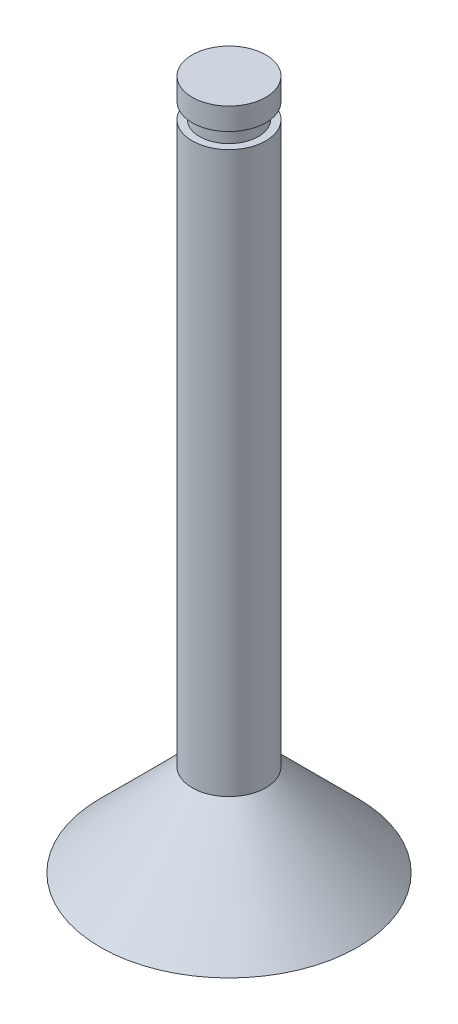
ISO-10303-21;
HEADER;
FILE_DESCRIPTION(('STEP AP214'),'2;1');
FILE_NAME('part.step','',(''),(''),'','','');
FILE_SCHEMA(('AUTOMOTIVE_DESIGN { 1 0 10303 214 1 1 1 1 }'));
ENDSEC;
DATA;
#1=APPLICATION_CONTEXT('core data for automotive mechanical design processes');
#2=APPLICATION_PROTOCOL_DEFINITION('international standard','automotive_design',2000,#1);
#3=PRODUCT_CONTEXT('',#1,'mechanical');
#4=PRODUCT('Part','Part','',(#3));
#5=PRODUCT_RELATED_PRODUCT_CATEGORY('part','',(#4));
#6=PRODUCT_DEFINITION_FORMATION('','',#4);
#7=PRODUCT_DEFINITION_CONTEXT('part definition',#1,'design');
#8=PRODUCT_DEFINITION('design','',#6,#7);
#9=PRODUCT_DEFINITION_SHAPE('','',#8);
#10=(LENGTH_UNIT() NAMED_UNIT(*) SI_UNIT(.MILLI.,.METRE.));
#11=(NAMED_UNIT(*) PLANE_ANGLE_UNIT() SI_UNIT($,.RADIAN.));
#12=(NAMED_UNIT(*) SI_UNIT($,.STERADIAN.) SOLID_ANGLE_UNIT());
#13=UNCERTAINTY_MEASURE_WITH_UNIT(LENGTH_MEASURE(1.E-05),#10,'distance_accuracy_value','');
#14=(GEOMETRIC_REPRESENTATION_CONTEXT(3) GLOBAL_UNCERTAINTY_ASSIGNED_CONTEXT((#13)) GLOBAL_UNIT_ASSIGNED_CONTEXT((#10,
#11,#12)) REPRESENTATION_CONTEXT('',''));
#15=CARTESIAN_POINT('',(0.,0.,0.));
#16=DIRECTION('',(0.,0.,1.));
#17=DIRECTION('',(1.,0.,0.));
#18=AXIS2_PLACEMENT_3D('',#15,#16,#17);
#19=CARTESIAN_POINT('',(0.,0.,0.));
#20=DIRECTION('',(0.,1.,0.));
#21=DIRECTION('',(0.,0.,1.));
#22=AXIS2_PLACEMENT_3D('',#19,#20,#21);
#23=PLANE('',#22);
#24=CARTESIAN_POINT('',(0.,0.,0.));
#25=DIRECTION('',(0.,1.,0.));
#26=DIRECTION('',(0.,0.,1.));
#27=AXIS2_PLACEMENT_3D('',#24,#25,#26);
#28=CIRCLE('',#27,7.);
#29=CARTESIAN_POINT('',(0.,0.,7.));
#30=VERTEX_POINT('',#29);
#31=EDGE_CURVE('E10',#30,#30,#28,.T.);
#32=ORIENTED_EDGE('',*,*,#31,.F.);
#33=EDGE_LOOP('',(#32));
#34=FACE_BOUND('',#33,.T.);
#35=ADVANCED_FACE('F43',(#34),#23,.F.);
#36=CARTESIAN_POINT('',(0.,0.,0.));
#37=DIRECTION('',(0.,-1.,0.));
#38=DIRECTION('',(0.,0.,-1.));
#39=AXIS2_PLACEMENT_3D('',#36,#37,#38);
#40=CONICAL_SURFACE('',#39,7.,0.785398163397454);
#41=CARTESIAN_POINT('',(0.,4.99999999999994,0.));
#42=DIRECTION('',(0.,1.,0.));
#43=DIRECTION('',(0.,0.,1.));
#44=AXIS2_PLACEMENT_3D('',#41,#42,#43);
#45=CIRCLE('',#44,2.00000000000001);
#46=CARTESIAN_POINT('',(0.,4.99999999999994,2.00000000000001));
#47=VERTEX_POINT('',#46);
#48=EDGE_CURVE('E50',#47,#47,#45,.T.);
#49=ORIENTED_EDGE('',*,*,#48,.F.);
#50=EDGE_LOOP('',(#49));
#51=FACE_BOUND('',#50,.T.);
#52=ORIENTED_EDGE('',*,*,#31,.T.);
#53=EDGE_LOOP('',(#52));
#54=FACE_BOUND('',#53,.T.);
#55=ADVANCED_FACE('F107',(#51,#54),#40,.T.);
#56=CARTESIAN_POINT('',(0.,39.7321428571428,0.));
#57=DIRECTION('',(0.,1.,0.));
#58=DIRECTION('',(0.,0.,1.));
#59=AXIS2_PLACEMENT_3D('',#56,#57,#58);
#60=CYLINDRICAL_SURFACE('',#59,2.00000000000001);
#61=CARTESIAN_POINT('',(0.,35.45,0.));
#62=DIRECTION('',(0.,1.,0.));
#63=DIRECTION('',(0.,0.,1.));
#64=AXIS2_PLACEMENT_3D('',#61,#62,#63);
#65=CIRCLE('',#64,2.00000000000001);
#66=CARTESIAN_POINT('',(0.,35.45,2.00000000000001));
#67=VERTEX_POINT('',#66);
#68=EDGE_CURVE('E55',#67,#67,#65,.T.);
#69=ORIENTED_EDGE('',*,*,#68,.F.);
#70=EDGE_LOOP('',(#69));
#71=FACE_BOUND('',#70,.T.);
#72=ORIENTED_EDGE('',*,*,#48,.T.);
#73=EDGE_LOOP('',(#72));
#74=FACE_BOUND('',#73,.T.);
#75=ADVANCED_FACE('F102',(#71,#74),#60,.T.);
#76=CARTESIAN_POINT('',(2.00000000000001,35.45,0.));
#77=DIRECTION('',(0.,-1.,0.));
#78=DIRECTION('',(0.,0.,-1.));
#79=AXIS2_PLACEMENT_3D('',#76,#77,#78);
#80=PLANE('',#79);
#81=CARTESIAN_POINT('',(0.,35.45,0.));
#82=DIRECTION('',(0.,1.,0.));
#83=DIRECTION('',(0.,0.,1.));
#84=AXIS2_PLACEMENT_3D('',#81,#82,#83);
#85=CIRCLE('',#84,1.6);
#86=CARTESIAN_POINT('',(0.,35.45,1.6));
#87=VERTEX_POINT('',#86);
#88=EDGE_CURVE('E60',#87,#87,#85,.T.);
#89=ORIENTED_EDGE('',*,*,#88,.F.);
#90=EDGE_LOOP('',(#89));
#91=FACE_BOUND('',#90,.T.);
#92=ORIENTED_EDGE('',*,*,#68,.T.);
#93=EDGE_LOOP('',(#92));
#94=FACE_BOUND('',#93,.T.);
#95=ADVANCED_FACE('F96',(#91,#94),#80,.F.);
#96=CARTESIAN_POINT('',(0.,39.7321428571428,0.));
#97=DIRECTION('',(0.,1.,0.));
#98=DIRECTION('',(0.,0.,1.));
#99=AXIS2_PLACEMENT_3D('',#96,#97,#98);
#100=CYLINDRICAL_SURFACE('',#99,1.6);
#101=CARTESIAN_POINT('',(0.,36.3,0.));
#102=DIRECTION('',(0.,1.,0.));
#103=DIRECTION('',(0.,0.,1.));
#104=AXIS2_PLACEMENT_3D('',#101,#102,#103);
#105=CIRCLE('',#104,1.6);
#106=CARTESIAN_POINT('',(0.,36.3,1.6));
#107=VERTEX_POINT('',#106);
#108=EDGE_CURVE('E66',#107,#107,#105,.T.);
#109=ORIENTED_EDGE('',*,*,#108,.F.);
#110=EDGE_LOOP('',(#109));
#111=FACE_BOUND('',#110,.T.);
#112=ORIENTED_EDGE('',*,*,#88,.T.);
#113=EDGE_LOOP('',(#112));
#114=FACE_BOUND('',#113,.T.);
#115=ADVANCED_FACE('F90',(#111,#114),#100,.T.);
#116=CARTESIAN_POINT('',(1.6,36.3,0.));
#117=DIRECTION('',(0.,1.,0.));
#118=DIRECTION('',(0.,0.,1.));
#119=AXIS2_PLACEMENT_3D('',#116,#117,#118);
#120=PLANE('',#119);
#121=CARTESIAN_POINT('',(0.,36.3,0.));
#122=DIRECTION('',(0.,1.,0.));
#123=DIRECTION('',(0.,0.,1.));
#124=AXIS2_PLACEMENT_3D('',#121,#122,#123);
#125=CIRCLE('',#124,2.);
#126=CARTESIAN_POINT('',(0.,36.3,2.));
#127=VERTEX_POINT('',#126);
#128=EDGE_CURVE('E70',#127,#127,#125,.T.);
#129=ORIENTED_EDGE('',*,*,#128,.F.);
#130=EDGE_LOOP('',(#129));
#131=FACE_BOUND('',#130,.T.);
#132=ORIENTED_EDGE('',*,*,#108,.T.);
#133=EDGE_LOOP('',(#132));
#134=FACE_BOUND('',#133,.T.);
#135=ADVANCED_FACE('F84',(#131,#134),#120,.F.);
#136=CARTESIAN_POINT('',(0.,39.7321428571428,0.));
#137=DIRECTION('',(0.,1.,0.));
#138=DIRECTION('',(0.,0.,1.));
#139=AXIS2_PLACEMENT_3D('',#136,#137,#138);
#140=CYLINDRICAL_SURFACE('',#139,2.00000000000001);
#141=CARTESIAN_POINT('',(0.,37.5,0.));
#142=DIRECTION('',(0.,1.,0.));
#143=DIRECTION('',(0.,0.,1.));
#144=AXIS2_PLACEMENT_3D('',#141,#142,#143);
#145=CIRCLE('',#144,2.00000000000001);
#146=CARTESIAN_POINT('',(0.,37.5,2.00000000000001));
#147=VERTEX_POINT('',#146);
#148=EDGE_CURVE('E74',#147,#147,#145,.T.);
#149=ORIENTED_EDGE('',*,*,#148,.F.);
#150=EDGE_LOOP('',(#149));
#151=FACE_BOUND('',#150,.T.);
#152=ORIENTED_EDGE('',*,*,#128,.T.);
#153=EDGE_LOOP('',(#152));
#154=FACE_BOUND('',#153,.T.);
#155=ADVANCED_FACE('F81',(#151,#154),#140,.T.);
#156=CARTESIAN_POINT('',(2.00000000000001,37.5,0.));
#157=DIRECTION('',(0.,-1.,0.));
#158=DIRECTION('',(0.,0.,-1.));
#159=AXIS2_PLACEMENT_3D('',#156,#157,#158);
#160=PLANE('',#159);
#161=ORIENTED_EDGE('',*,*,#148,.T.);
#162=EDGE_LOOP('',(#161));
#163=FACE_BOUND('',#162,.T.);
#164=ADVANCED_FACE('F79',(#163),#160,.F.);
#165=CLOSED_SHELL('',(#35,#55,#75,#95,#115,#135,#155,#164));
#166=MANIFOLD_SOLID_BREP('B2',#165);
#167=ADVANCED_BREP_SHAPE_REPRESENTATION('',(#18,#166),#14);
#168=SHAPE_DEFINITION_REPRESENTATION(#9,#167);
ENDSEC;
END-ISO-10303-21;
